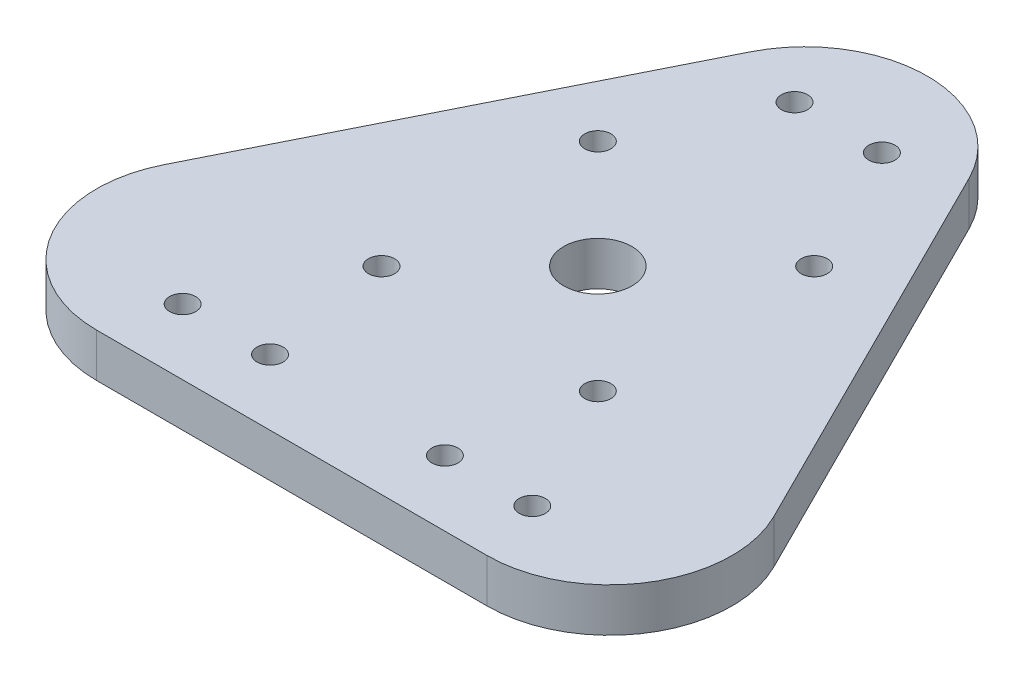
ISO-10303-21;
HEADER;
FILE_DESCRIPTION(('STEP AP214'),'2;1');
FILE_NAME('part.step','',(''),(''),'','','');
FILE_SCHEMA(('AUTOMOTIVE_DESIGN { 1 0 10303 214 1 1 1 1 }'));
ENDSEC;
DATA;
#1=APPLICATION_CONTEXT('core data for automotive mechanical design processes');
#2=APPLICATION_PROTOCOL_DEFINITION('international standard','automotive_design',2000,#1);
#3=PRODUCT_CONTEXT('',#1,'mechanical');
#4=PRODUCT('Part','Part','',(#3));
#5=PRODUCT_RELATED_PRODUCT_CATEGORY('part','',(#4));
#6=PRODUCT_DEFINITION_FORMATION('','',#4);
#7=PRODUCT_DEFINITION_CONTEXT('part definition',#1,'design');
#8=PRODUCT_DEFINITION('design','',#6,#7);
#9=PRODUCT_DEFINITION_SHAPE('','',#8);
#10=(LENGTH_UNIT() NAMED_UNIT(*) SI_UNIT(.MILLI.,.METRE.));
#11=(NAMED_UNIT(*) PLANE_ANGLE_UNIT() SI_UNIT($,.RADIAN.));
#12=(NAMED_UNIT(*) SI_UNIT($,.STERADIAN.) SOLID_ANGLE_UNIT());
#13=UNCERTAINTY_MEASURE_WITH_UNIT(LENGTH_MEASURE(1.E-05),#10,'distance_accuracy_value','');
#14=(GEOMETRIC_REPRESENTATION_CONTEXT(3) GLOBAL_UNCERTAINTY_ASSIGNED_CONTEXT((#13)) GLOBAL_UNIT_ASSIGNED_CONTEXT((#10,
#11,#12)) REPRESENTATION_CONTEXT('',''));
#15=CARTESIAN_POINT('',(0.,0.,0.));
#16=DIRECTION('',(0.,0.,1.));
#17=DIRECTION('',(1.,0.,0.));
#18=AXIS2_PLACEMENT_3D('',#15,#16,#17);
#19=CARTESIAN_POINT('',(0.,0.,0.));
#20=DIRECTION('',(0.,-1.,0.));
#21=DIRECTION('',(0.,0.,-1.));
#22=AXIS2_PLACEMENT_3D('',#19,#20,#21);
#23=PLANE('',#22);
#24=CARTESIAN_POINT('',(15.7154482118709,0.,-28.7345517881289));
#25=DIRECTION('',(0.,1.,0.));
#26=DIRECTION('',(0.,0.,1.));
#27=AXIS2_PLACEMENT_3D('',#24,#25,#26);
#28=CIRCLE('',#27,1.89865);
#29=CARTESIAN_POINT('',(15.7154482118709,0.,-26.8359017881289));
#30=VERTEX_POINT('',#29);
#31=EDGE_CURVE('E203',#30,#30,#28,.T.);
#32=ORIENTED_EDGE('',*,*,#31,.F.);
#33=EDGE_LOOP('',(#32));
#34=FACE_BOUND('',#33,.T.);
#35=CARTESIAN_POINT('',(15.7154482118712,0.,-60.1654482118709));
#36=DIRECTION('',(0.,1.,0.));
#37=DIRECTION('',(0.,0.,1.));
#38=AXIS2_PLACEMENT_3D('',#35,#36,#37);
#39=CIRCLE('',#38,1.89865);
#40=CARTESIAN_POINT('',(15.7154482118712,0.,-58.2667982118709));
#41=VERTEX_POINT('',#40);
#42=EDGE_CURVE('E191',#41,#41,#39,.T.);
#43=ORIENTED_EDGE('',*,*,#42,.F.);
#44=EDGE_LOOP('',(#43));
#45=FACE_BOUND('',#44,.T.);
#46=CARTESIAN_POINT('',(0.,0.,-44.45));
#47=DIRECTION('',(0.,1.,0.));
#48=DIRECTION('',(0.,0.,1.));
#49=AXIS2_PLACEMENT_3D('',#46,#47,#48);
#50=CIRCLE('',#49,4.96062);
#51=CARTESIAN_POINT('',(0.,0.,-39.48938));
#52=VERTEX_POINT('',#51);
#53=EDGE_CURVE('E185',#52,#52,#50,.T.);
#54=ORIENTED_EDGE('',*,*,#53,.F.);
#55=EDGE_LOOP('',(#54));
#56=FACE_BOUND('',#55,.T.);
#57=CARTESIAN_POINT('',(25.4,0.,-9.525));
#58=DIRECTION('',(0.,1.,0.));
#59=DIRECTION('',(0.,0.,1.));
#60=AXIS2_PLACEMENT_3D('',#57,#58,#59);
#61=CIRCLE('',#60,1.89864999999999);
#62=CARTESIAN_POINT('',(25.4,0.,-7.62635000000001));
#63=VERTEX_POINT('',#62);
#64=EDGE_CURVE('E179',#63,#63,#61,.T.);
#65=ORIENTED_EDGE('',*,*,#64,.F.);
#66=EDGE_LOOP('',(#65));
#67=FACE_BOUND('',#66,.T.);
#68=CARTESIAN_POINT('',(12.7,0.,-9.525));
#69=DIRECTION('',(0.,1.,0.));
#70=DIRECTION('',(0.,0.,1.));
#71=AXIS2_PLACEMENT_3D('',#68,#69,#70);
#72=CIRCLE('',#71,1.89864999999999);
#73=CARTESIAN_POINT('',(12.7,0.,-7.62635000000001));
#74=VERTEX_POINT('',#73);
#75=EDGE_CURVE('E173',#74,#74,#72,.T.);
#76=ORIENTED_EDGE('',*,*,#75,.F.);
#77=EDGE_LOOP('',(#76));
#78=FACE_BOUND('',#77,.T.);
#79=CARTESIAN_POINT('',(-6.35,0.,-79.375));
#80=DIRECTION('',(0.,1.,0.));
#81=DIRECTION('',(0.,0.,1.));
#82=AXIS2_PLACEMENT_3D('',#79,#80,#81);
#83=CIRCLE('',#82,1.89864999999999);
#84=CARTESIAN_POINT('',(-6.35,0.,-77.47635));
#85=VERTEX_POINT('',#84);
#86=EDGE_CURVE('E167',#85,#85,#83,.T.);
#87=ORIENTED_EDGE('',*,*,#86,.F.);
#88=EDGE_LOOP('',(#87));
#89=FACE_BOUND('',#88,.T.);
#90=CARTESIAN_POINT('',(6.35,0.,-79.375));
#91=DIRECTION('',(0.,1.,0.));
#92=DIRECTION('',(0.,0.,1.));
#93=AXIS2_PLACEMENT_3D('',#90,#91,#92);
#94=CIRCLE('',#93,1.89864999999999);
#95=CARTESIAN_POINT('',(6.35,0.,-77.47635));
#96=VERTEX_POINT('',#95);
#97=EDGE_CURVE('E161',#96,#96,#94,.T.);
#98=ORIENTED_EDGE('',*,*,#97,.F.);
#99=EDGE_LOOP('',(#98));
#100=FACE_BOUND('',#99,.T.);
#101=CARTESIAN_POINT('',(-25.4,0.,-9.525));
#102=DIRECTION('',(0.,1.,0.));
#103=DIRECTION('',(0.,0.,1.));
#104=AXIS2_PLACEMENT_3D('',#101,#102,#103);
#105=CIRCLE('',#104,1.89864999999999);
#106=CARTESIAN_POINT('',(-25.4,0.,-7.62635000000001));
#107=VERTEX_POINT('',#106);
#108=EDGE_CURVE('E153',#107,#107,#105,.T.);
#109=ORIENTED_EDGE('',*,*,#108,.F.);
#110=EDGE_LOOP('',(#109));
#111=FACE_BOUND('',#110,.T.);
#112=CARTESIAN_POINT('',(-12.7,0.,-9.525));
#113=DIRECTION('',(0.,1.,0.));
#114=DIRECTION('',(0.,0.,1.));
#115=AXIS2_PLACEMENT_3D('',#112,#113,#114);
#116=CIRCLE('',#115,1.89864999999999);
#117=CARTESIAN_POINT('',(-12.7,0.,-7.62635000000001));
#118=VERTEX_POINT('',#117);
#119=EDGE_CURVE('E145',#118,#118,#116,.T.);
#120=ORIENTED_EDGE('',*,*,#119,.F.);
#121=EDGE_LOOP('',(#120));
#122=FACE_BOUND('',#121,.T.);
#123=DIRECTION('',(-0.447213595499958,0.,-0.894427190999916));
#124=VECTOR('',#123,1.);
#125=CARTESIAN_POINT('',(0.,0.,-114.3));
#126=LINE('',#125,#124);
#127=CARTESIAN_POINT('',(44.2842711360054,0.,-25.7314577279893));
#128=VERTEX_POINT('',#127);
#129=CARTESIAN_POINT('',(15.9029154559785,0.,-82.494169088043));
#130=VERTEX_POINT('',#129);
#131=EDGE_CURVE('E89',#128,#130,#126,.T.);
#132=ORIENTED_EDGE('',*,*,#131,.T.);
#133=CARTESIAN_POINT('',(0.,0.,-74.5427113600537));
#134=DIRECTION('',(0.,-1.,0.));
#135=DIRECTION('',(0.,0.,-1.));
#136=AXIS2_PLACEMENT_3D('',#133,#134,#135);
#137=CIRCLE('',#136,17.78);
#138=CARTESIAN_POINT('',(-15.9029154559785,0.,-82.494169088043));
#139=VERTEX_POINT('',#138);
#140=EDGE_CURVE('E94',#130,#139,#137,.F.);
#141=ORIENTED_EDGE('',*,*,#140,.T.);
#142=DIRECTION('',(-0.447213595499958,0.,0.894427190999916));
#143=VECTOR('',#142,1.);
#144=CARTESIAN_POINT('',(-57.15,0.,0.));
#145=LINE('',#144,#143);
#146=CARTESIAN_POINT('',(-44.2842711360054,0.,-25.7314577279893));
#147=VERTEX_POINT('',#146);
#148=EDGE_CURVE('E104',#139,#147,#145,.T.);
#149=ORIENTED_EDGE('',*,*,#148,.T.);
#150=CARTESIAN_POINT('',(-28.3813556800269,0.,-17.78));
#151=DIRECTION('',(0.,-1.,0.));
#152=DIRECTION('',(0.,0.,-1.));
#153=AXIS2_PLACEMENT_3D('',#150,#151,#152);
#154=CIRCLE('',#153,17.78);
#155=CARTESIAN_POINT('',(-28.3813556800269,0.,0.));
#156=VERTEX_POINT('',#155);
#157=EDGE_CURVE('E95',#147,#156,#154,.F.);
#158=ORIENTED_EDGE('',*,*,#157,.T.);
#159=DIRECTION('',(1.,0.,0.));
#160=VECTOR('',#159,1.);
#161=CARTESIAN_POINT('',(-57.15,0.,0.));
#162=LINE('',#161,#160);
#163=CARTESIAN_POINT('',(28.3813556800269,0.,0.));
#164=VERTEX_POINT('',#163);
#165=EDGE_CURVE('E90',#156,#164,#162,.T.);
#166=ORIENTED_EDGE('',*,*,#165,.T.);
#167=CARTESIAN_POINT('',(28.3813556800269,0.,-17.78));
#168=DIRECTION('',(0.,-1.,0.));
#169=DIRECTION('',(0.,0.,-1.));
#170=AXIS2_PLACEMENT_3D('',#167,#168,#169);
#171=CIRCLE('',#170,17.78);
#172=EDGE_CURVE('E86',#164,#128,#171,.F.);
#173=ORIENTED_EDGE('',*,*,#172,.T.);
#174=EDGE_LOOP('',(#132,#141,#149,#158,#166,#173));
#175=FACE_BOUND('',#174,.T.);
#176=CARTESIAN_POINT('',(-15.7154482118712,0.,-28.7345517881291));
#177=DIRECTION('',(0.,1.,0.));
#178=DIRECTION('',(0.,0.,1.));
#179=AXIS2_PLACEMENT_3D('',#176,#177,#178);
#180=CIRCLE('',#179,1.89865);
#181=CARTESIAN_POINT('',(-15.7154482118712,0.,-26.8359017881291));
#182=VERTEX_POINT('',#181);
#183=EDGE_CURVE('E197',#182,#182,#180,.T.);
#184=ORIENTED_EDGE('',*,*,#183,.F.);
#185=EDGE_LOOP('',(#184));
#186=FACE_BOUND('',#185,.T.);
#187=CARTESIAN_POINT('',(-15.7154482118709,0.,-60.1654482118711));
#188=DIRECTION('',(0.,1.,0.));
#189=DIRECTION('',(0.,0.,1.));
#190=AXIS2_PLACEMENT_3D('',#187,#188,#189);
#191=CIRCLE('',#190,1.89865);
#192=CARTESIAN_POINT('',(-15.7154482118709,0.,-58.2667982118711));
#193=VERTEX_POINT('',#192);
#194=EDGE_CURVE('E209',#193,#193,#191,.T.);
#195=ORIENTED_EDGE('',*,*,#194,.F.);
#196=EDGE_LOOP('',(#195));
#197=FACE_BOUND('',#196,.T.);
#198=ADVANCED_FACE('F32',(#34,#45,#56,#67,#78,#89,#100,#111,#122,#175,#186,#197),#23,.F.);
#199=CARTESIAN_POINT('',(-57.15,-6.35,0.));
#200=DIRECTION('',(0.,0.,1.));
#201=DIRECTION('',(1.,0.,0.));
#202=AXIS2_PLACEMENT_3D('',#199,#200,#201);
#203=PLANE('',#202);
#204=DIRECTION('',(1.,0.,0.));
#205=VECTOR('',#204,1.);
#206=CARTESIAN_POINT('',(-57.15,-6.35,0.));
#207=LINE('',#206,#205);
#208=CARTESIAN_POINT('',(-28.3813556800269,-6.35,0.));
#209=VERTEX_POINT('',#208);
#210=CARTESIAN_POINT('',(28.3813556800269,-6.35,0.));
#211=VERTEX_POINT('',#210);
#212=EDGE_CURVE('E131',#209,#211,#207,.T.);
#213=ORIENTED_EDGE('',*,*,#212,.T.);
#214=DIRECTION('',(0.,1.,0.));
#215=VECTOR('',#214,1.);
#216=CARTESIAN_POINT('',(28.3813556800269,-6.35,0.));
#217=LINE('',#216,#215);
#218=EDGE_CURVE('E11',#211,#164,#217,.T.);
#219=ORIENTED_EDGE('',*,*,#218,.T.);
#220=ORIENTED_EDGE('',*,*,#165,.F.);
#221=DIRECTION('',(0.,1.,0.));
#222=VECTOR('',#221,1.);
#223=CARTESIAN_POINT('',(-28.3813556800269,-6.35,0.));
#224=LINE('',#223,#222);
#225=EDGE_CURVE('E40',#156,#209,#224,.F.);
#226=ORIENTED_EDGE('',*,*,#225,.T.);
#227=EDGE_LOOP('',(#213,#219,#220,#226));
#228=FACE_BOUND('',#227,.T.);
#229=ADVANCED_FACE('F217',(#228),#203,.T.);
#230=CARTESIAN_POINT('',(-57.15,-6.35,0.));
#231=DIRECTION('',(-0.894427190999916,0.,-0.447213595499958));
#232=DIRECTION('',(-0.447213595499958,0.,0.894427190999916));
#233=AXIS2_PLACEMENT_3D('',#230,#231,#232);
#234=PLANE('',#233);
#235=ORIENTED_EDGE('',*,*,#148,.F.);
#236=DIRECTION('',(0.,1.,0.));
#237=VECTOR('',#236,1.);
#238=CARTESIAN_POINT('',(-15.9029154559785,-6.35,-82.494169088043));
#239=LINE('',#238,#237);
#240=CARTESIAN_POINT('',(-15.9029154559785,-6.35,-82.494169088043));
#241=VERTEX_POINT('',#240);
#242=EDGE_CURVE('E120',#139,#241,#239,.F.);
#243=ORIENTED_EDGE('',*,*,#242,.T.);
#244=DIRECTION('',(-0.447213595499958,0.,0.894427190999916));
#245=VECTOR('',#244,1.);
#246=CARTESIAN_POINT('',(-57.15,-6.35,0.));
#247=LINE('',#246,#245);
#248=CARTESIAN_POINT('',(-44.2842711360054,-6.35,-25.7314577279893));
#249=VERTEX_POINT('',#248);
#250=EDGE_CURVE('E107',#241,#249,#247,.T.);
#251=ORIENTED_EDGE('',*,*,#250,.T.);
#252=DIRECTION('',(0.,1.,0.));
#253=VECTOR('',#252,1.);
#254=CARTESIAN_POINT('',(-44.2842711360054,-6.35,-25.7314577279893));
#255=LINE('',#254,#253);
#256=EDGE_CURVE('E117',#249,#147,#255,.T.);
#257=ORIENTED_EDGE('',*,*,#256,.T.);
#258=EDGE_LOOP('',(#235,#243,#251,#257));
#259=FACE_BOUND('',#258,.T.);
#260=ADVANCED_FACE('F137',(#259),#234,.T.);
#261=CARTESIAN_POINT('',(0.,-6.35,-114.3));
#262=DIRECTION('',(0.894427190999916,0.,-0.447213595499958));
#263=DIRECTION('',(-0.447213595499958,0.,-0.894427190999916));
#264=AXIS2_PLACEMENT_3D('',#261,#262,#263);
#265=PLANE('',#264);
#266=DIRECTION('',(-0.447213595499958,0.,-0.894427190999916));
#267=VECTOR('',#266,1.);
#268=CARTESIAN_POINT('',(0.,-6.35,-114.3));
#269=LINE('',#268,#267);
#270=CARTESIAN_POINT('',(44.2842711360054,-6.35,-25.7314577279893));
#271=VERTEX_POINT('',#270);
#272=CARTESIAN_POINT('',(15.9029154559785,-6.35,-82.494169088043));
#273=VERTEX_POINT('',#272);
#274=EDGE_CURVE('E111',#271,#273,#269,.T.);
#275=ORIENTED_EDGE('',*,*,#274,.T.);
#276=DIRECTION('',(0.,1.,0.));
#277=VECTOR('',#276,1.);
#278=CARTESIAN_POINT('',(15.9029154559785,-6.35,-82.494169088043));
#279=LINE('',#278,#277);
#280=EDGE_CURVE('E103',#273,#130,#279,.T.);
#281=ORIENTED_EDGE('',*,*,#280,.T.);
#282=ORIENTED_EDGE('',*,*,#131,.F.);
#283=DIRECTION('',(0.,1.,0.));
#284=VECTOR('',#283,1.);
#285=CARTESIAN_POINT('',(44.2842711360054,-6.35,-25.7314577279893));
#286=LINE('',#285,#284);
#287=EDGE_CURVE('E101',#128,#271,#286,.F.);
#288=ORIENTED_EDGE('',*,*,#287,.T.);
#289=EDGE_LOOP('',(#275,#281,#282,#288));
#290=FACE_BOUND('',#289,.T.);
#291=ADVANCED_FACE('F100',(#290),#265,.T.);
#292=CARTESIAN_POINT('',(0.,-6.35,0.));
#293=DIRECTION('',(0.,-1.,0.));
#294=DIRECTION('',(0.,0.,-1.));
#295=AXIS2_PLACEMENT_3D('',#292,#293,#294);
#296=PLANE('',#295);
#297=CARTESIAN_POINT('',(-15.7154482118709,-6.35,-60.1654482118711));
#298=DIRECTION('',(0.,-1.,0.));
#299=DIRECTION('',(0.,0.,-1.));
#300=AXIS2_PLACEMENT_3D('',#297,#298,#299);
#301=CIRCLE('',#300,1.89865);
#302=CARTESIAN_POINT('',(-15.7154482118709,-6.35,-62.0640982118711));
#303=VERTEX_POINT('',#302);
#304=EDGE_CURVE('E206',#303,#303,#301,.T.);
#305=ORIENTED_EDGE('',*,*,#304,.F.);
#306=EDGE_LOOP('',(#305));
#307=FACE_BOUND('',#306,.T.);
#308=CARTESIAN_POINT('',(15.7154482118709,-6.35,-28.7345517881289));
#309=DIRECTION('',(0.,-1.,0.));
#310=DIRECTION('',(0.,0.,-1.));
#311=AXIS2_PLACEMENT_3D('',#308,#309,#310);
#312=CIRCLE('',#311,1.89865);
#313=CARTESIAN_POINT('',(15.7154482118709,-6.35,-30.6332017881289));
#314=VERTEX_POINT('',#313);
#315=EDGE_CURVE('E200',#314,#314,#312,.T.);
#316=ORIENTED_EDGE('',*,*,#315,.F.);
#317=EDGE_LOOP('',(#316));
#318=FACE_BOUND('',#317,.T.);
#319=CARTESIAN_POINT('',(-15.7154482118712,-6.35,-28.7345517881291));
#320=DIRECTION('',(0.,-1.,0.));
#321=DIRECTION('',(0.,0.,-1.));
#322=AXIS2_PLACEMENT_3D('',#319,#320,#321);
#323=CIRCLE('',#322,1.89865);
#324=CARTESIAN_POINT('',(-15.7154482118712,-6.35,-30.6332017881291));
#325=VERTEX_POINT('',#324);
#326=EDGE_CURVE('E194',#325,#325,#323,.T.);
#327=ORIENTED_EDGE('',*,*,#326,.F.);
#328=EDGE_LOOP('',(#327));
#329=FACE_BOUND('',#328,.T.);
#330=CARTESIAN_POINT('',(15.7154482118712,-6.35,-60.1654482118709));
#331=DIRECTION('',(0.,-1.,0.));
#332=DIRECTION('',(0.,0.,-1.));
#333=AXIS2_PLACEMENT_3D('',#330,#331,#332);
#334=CIRCLE('',#333,1.89865);
#335=CARTESIAN_POINT('',(15.7154482118712,-6.35,-62.0640982118709));
#336=VERTEX_POINT('',#335);
#337=EDGE_CURVE('E188',#336,#336,#334,.T.);
#338=ORIENTED_EDGE('',*,*,#337,.F.);
#339=EDGE_LOOP('',(#338));
#340=FACE_BOUND('',#339,.T.);
#341=CARTESIAN_POINT('',(0.,-6.35,-44.45));
#342=DIRECTION('',(0.,1.,0.));
#343=DIRECTION('',(0.,0.,1.));
#344=AXIS2_PLACEMENT_3D('',#341,#342,#343);
#345=CIRCLE('',#344,4.96062);
#346=CARTESIAN_POINT('',(0.,-6.35,-39.48938));
#347=VERTEX_POINT('',#346);
#348=EDGE_CURVE('E182',#347,#347,#345,.T.);
#349=ORIENTED_EDGE('',*,*,#348,.T.);
#350=EDGE_LOOP('',(#349));
#351=FACE_BOUND('',#350,.T.);
#352=CARTESIAN_POINT('',(25.4,-6.34999999999999,-9.525));
#353=DIRECTION('',(0.,1.,0.));
#354=DIRECTION('',(0.,0.,1.));
#355=AXIS2_PLACEMENT_3D('',#352,#353,#354);
#356=CIRCLE('',#355,1.89864999999999);
#357=CARTESIAN_POINT('',(25.4,-6.34999999999999,-7.62635000000001));
#358=VERTEX_POINT('',#357);
#359=EDGE_CURVE('E176',#358,#358,#356,.T.);
#360=ORIENTED_EDGE('',*,*,#359,.T.);
#361=EDGE_LOOP('',(#360));
#362=FACE_BOUND('',#361,.T.);
#363=CARTESIAN_POINT('',(12.7,-6.34999999999999,-9.525));
#364=DIRECTION('',(0.,1.,0.));
#365=DIRECTION('',(0.,0.,1.));
#366=AXIS2_PLACEMENT_3D('',#363,#364,#365);
#367=CIRCLE('',#366,1.89864999999999);
#368=CARTESIAN_POINT('',(12.7,-6.34999999999999,-7.62635000000001));
#369=VERTEX_POINT('',#368);
#370=EDGE_CURVE('E170',#369,#369,#367,.T.);
#371=ORIENTED_EDGE('',*,*,#370,.T.);
#372=EDGE_LOOP('',(#371));
#373=FACE_BOUND('',#372,.T.);
#374=CARTESIAN_POINT('',(-6.35,-6.34999999999999,-79.375));
#375=DIRECTION('',(0.,1.,0.));
#376=DIRECTION('',(0.,0.,1.));
#377=AXIS2_PLACEMENT_3D('',#374,#375,#376);
#378=CIRCLE('',#377,1.89864999999999);
#379=CARTESIAN_POINT('',(-6.35,-6.34999999999999,-77.47635));
#380=VERTEX_POINT('',#379);
#381=EDGE_CURVE('E164',#380,#380,#378,.T.);
#382=ORIENTED_EDGE('',*,*,#381,.T.);
#383=EDGE_LOOP('',(#382));
#384=FACE_BOUND('',#383,.T.);
#385=CARTESIAN_POINT('',(6.35,-6.34999999999999,-79.375));
#386=DIRECTION('',(0.,1.,0.));
#387=DIRECTION('',(0.,0.,1.));
#388=AXIS2_PLACEMENT_3D('',#385,#386,#387);
#389=CIRCLE('',#388,1.89864999999999);
#390=CARTESIAN_POINT('',(6.35,-6.34999999999999,-77.47635));
#391=VERTEX_POINT('',#390);
#392=EDGE_CURVE('E158',#391,#391,#389,.T.);
#393=ORIENTED_EDGE('',*,*,#392,.T.);
#394=EDGE_LOOP('',(#393));
#395=FACE_BOUND('',#394,.T.);
#396=CARTESIAN_POINT('',(-25.4,-6.34999999999999,-9.525));
#397=DIRECTION('',(0.,1.,0.));
#398=DIRECTION('',(0.,0.,1.));
#399=AXIS2_PLACEMENT_3D('',#396,#397,#398);
#400=CIRCLE('',#399,1.89864999999999);
#401=CARTESIAN_POINT('',(-25.4,-6.34999999999999,-7.62635000000001));
#402=VERTEX_POINT('',#401);
#403=EDGE_CURVE('E149',#402,#402,#400,.T.);
#404=ORIENTED_EDGE('',*,*,#403,.T.);
#405=EDGE_LOOP('',(#404));
#406=FACE_BOUND('',#405,.T.);
#407=CARTESIAN_POINT('',(-12.7,-6.34999999999999,-9.525));
#408=DIRECTION('',(0.,1.,0.));
#409=DIRECTION('',(0.,0.,1.));
#410=AXIS2_PLACEMENT_3D('',#407,#408,#409);
#411=CIRCLE('',#410,1.89864999999999);
#412=CARTESIAN_POINT('',(-12.7,-6.34999999999999,-7.62635000000001));
#413=VERTEX_POINT('',#412);
#414=EDGE_CURVE('E141',#413,#413,#411,.T.);
#415=ORIENTED_EDGE('',*,*,#414,.T.);
#416=EDGE_LOOP('',(#415));
#417=FACE_BOUND('',#416,.T.);
#418=ORIENTED_EDGE('',*,*,#250,.F.);
#419=CARTESIAN_POINT('',(0.,-6.35,-74.5427113600537));
#420=DIRECTION('',(0.,-1.,0.));
#421=DIRECTION('',(0.,0.,-1.));
#422=AXIS2_PLACEMENT_3D('',#419,#420,#421);
#423=CIRCLE('',#422,17.78);
#424=EDGE_CURVE('E125',#241,#273,#423,.T.);
#425=ORIENTED_EDGE('',*,*,#424,.T.);
#426=ORIENTED_EDGE('',*,*,#274,.F.);
#427=CARTESIAN_POINT('',(28.3813556800269,-6.35,-17.78));
#428=DIRECTION('',(0.,-1.,0.));
#429=DIRECTION('',(0.,0.,-1.));
#430=AXIS2_PLACEMENT_3D('',#427,#428,#429);
#431=CIRCLE('',#430,17.78);
#432=EDGE_CURVE('E47',#271,#211,#431,.T.);
#433=ORIENTED_EDGE('',*,*,#432,.T.);
#434=ORIENTED_EDGE('',*,*,#212,.F.);
#435=CARTESIAN_POINT('',(-28.3813556800269,-6.35,-17.78));
#436=DIRECTION('',(0.,-1.,0.));
#437=DIRECTION('',(0.,0.,-1.));
#438=AXIS2_PLACEMENT_3D('',#435,#436,#437);
#439=CIRCLE('',#438,17.78);
#440=EDGE_CURVE('E122',#209,#249,#439,.T.);
#441=ORIENTED_EDGE('',*,*,#440,.T.);
#442=EDGE_LOOP('',(#418,#425,#426,#433,#434,#441));
#443=FACE_BOUND('',#442,.T.);
#444=ADVANCED_FACE('F128',(#307,#318,#329,#340,#351,#362,#373,#384,#395,#406,#417,#443),#296,.T.);
#445=CARTESIAN_POINT('',(-12.7,0.,-9.525));
#446=DIRECTION('',(0.,1.,0.));
#447=DIRECTION('',(0.,0.,1.));
#448=AXIS2_PLACEMENT_3D('',#445,#446,#447);
#449=CYLINDRICAL_SURFACE('',#448,1.89864999999999);
#450=ORIENTED_EDGE('',*,*,#414,.F.);
#451=EDGE_LOOP('',(#450));
#452=FACE_BOUND('',#451,.T.);
#453=ORIENTED_EDGE('',*,*,#119,.T.);
#454=EDGE_LOOP('',(#453));
#455=FACE_BOUND('',#454,.T.);
#456=ADVANCED_FACE('F275',(#452,#455),#449,.F.);
#457=CARTESIAN_POINT('',(-25.4,0.,-9.525));
#458=DIRECTION('',(0.,1.,0.));
#459=DIRECTION('',(0.,0.,1.));
#460=AXIS2_PLACEMENT_3D('',#457,#458,#459);
#461=CYLINDRICAL_SURFACE('',#460,1.89864999999999);
#462=ORIENTED_EDGE('',*,*,#403,.F.);
#463=EDGE_LOOP('',(#462));
#464=FACE_BOUND('',#463,.T.);
#465=ORIENTED_EDGE('',*,*,#108,.T.);
#466=EDGE_LOOP('',(#465));
#467=FACE_BOUND('',#466,.T.);
#468=ADVANCED_FACE('F272',(#464,#467),#461,.F.);
#469=CARTESIAN_POINT('',(6.35,0.,-79.375));
#470=DIRECTION('',(0.,1.,0.));
#471=DIRECTION('',(0.,0.,1.));
#472=AXIS2_PLACEMENT_3D('',#469,#470,#471);
#473=CYLINDRICAL_SURFACE('',#472,1.89864999999999);
#474=ORIENTED_EDGE('',*,*,#392,.F.);
#475=EDGE_LOOP('',(#474));
#476=FACE_BOUND('',#475,.T.);
#477=ORIENTED_EDGE('',*,*,#97,.T.);
#478=EDGE_LOOP('',(#477));
#479=FACE_BOUND('',#478,.T.);
#480=ADVANCED_FACE('F268',(#476,#479),#473,.F.);
#481=CARTESIAN_POINT('',(-6.35,0.,-79.375));
#482=DIRECTION('',(0.,1.,0.));
#483=DIRECTION('',(0.,0.,1.));
#484=AXIS2_PLACEMENT_3D('',#481,#482,#483);
#485=CYLINDRICAL_SURFACE('',#484,1.89864999999999);
#486=ORIENTED_EDGE('',*,*,#381,.F.);
#487=EDGE_LOOP('',(#486));
#488=FACE_BOUND('',#487,.T.);
#489=ORIENTED_EDGE('',*,*,#86,.T.);
#490=EDGE_LOOP('',(#489));
#491=FACE_BOUND('',#490,.T.);
#492=ADVANCED_FACE('F264',(#488,#491),#485,.F.);
#493=CARTESIAN_POINT('',(12.7,0.,-9.525));
#494=DIRECTION('',(0.,1.,0.));
#495=DIRECTION('',(0.,0.,1.));
#496=AXIS2_PLACEMENT_3D('',#493,#494,#495);
#497=CYLINDRICAL_SURFACE('',#496,1.89864999999999);
#498=ORIENTED_EDGE('',*,*,#370,.F.);
#499=EDGE_LOOP('',(#498));
#500=FACE_BOUND('',#499,.T.);
#501=ORIENTED_EDGE('',*,*,#75,.T.);
#502=EDGE_LOOP('',(#501));
#503=FACE_BOUND('',#502,.T.);
#504=ADVANCED_FACE('F260',(#500,#503),#497,.F.);
#505=CARTESIAN_POINT('',(25.4,0.,-9.525));
#506=DIRECTION('',(0.,1.,0.));
#507=DIRECTION('',(0.,0.,1.));
#508=AXIS2_PLACEMENT_3D('',#505,#506,#507);
#509=CYLINDRICAL_SURFACE('',#508,1.89864999999999);
#510=ORIENTED_EDGE('',*,*,#359,.F.);
#511=EDGE_LOOP('',(#510));
#512=FACE_BOUND('',#511,.T.);
#513=ORIENTED_EDGE('',*,*,#64,.T.);
#514=EDGE_LOOP('',(#513));
#515=FACE_BOUND('',#514,.T.);
#516=ADVANCED_FACE('F234',(#512,#515),#509,.F.);
#517=CARTESIAN_POINT('',(0.,-6.35,-74.5427113600537));
#518=DIRECTION('',(0.,1.,0.));
#519=DIRECTION('',(0.,0.,1.));
#520=AXIS2_PLACEMENT_3D('',#517,#518,#519);
#521=CYLINDRICAL_SURFACE('',#520,17.78);
#522=ORIENTED_EDGE('',*,*,#424,.F.);
#523=ORIENTED_EDGE('',*,*,#242,.F.);
#524=ORIENTED_EDGE('',*,*,#140,.F.);
#525=ORIENTED_EDGE('',*,*,#280,.F.);
#526=EDGE_LOOP('',(#522,#523,#524,#525));
#527=FACE_BOUND('',#526,.T.);
#528=ADVANCED_FACE('F133',(#527),#521,.T.);
#529=CARTESIAN_POINT('',(28.3813556800269,-6.35,-17.78));
#530=DIRECTION('',(0.,1.,0.));
#531=DIRECTION('',(0.,0.,1.));
#532=AXIS2_PLACEMENT_3D('',#529,#530,#531);
#533=CYLINDRICAL_SURFACE('',#532,17.78);
#534=ORIENTED_EDGE('',*,*,#432,.F.);
#535=ORIENTED_EDGE('',*,*,#287,.F.);
#536=ORIENTED_EDGE('',*,*,#172,.F.);
#537=ORIENTED_EDGE('',*,*,#218,.F.);
#538=EDGE_LOOP('',(#534,#535,#536,#537));
#539=FACE_BOUND('',#538,.T.);
#540=ADVANCED_FACE('F106',(#539),#533,.T.);
#541=CARTESIAN_POINT('',(-28.3813556800269,-6.35,-17.78));
#542=DIRECTION('',(0.,1.,0.));
#543=DIRECTION('',(0.,0.,1.));
#544=AXIS2_PLACEMENT_3D('',#541,#542,#543);
#545=CYLINDRICAL_SURFACE('',#544,17.78);
#546=ORIENTED_EDGE('',*,*,#440,.F.);
#547=ORIENTED_EDGE('',*,*,#225,.F.);
#548=ORIENTED_EDGE('',*,*,#157,.F.);
#549=ORIENTED_EDGE('',*,*,#256,.F.);
#550=EDGE_LOOP('',(#546,#547,#548,#549));
#551=FACE_BOUND('',#550,.T.);
#552=ADVANCED_FACE('F34',(#551),#545,.T.);
#553=CARTESIAN_POINT('',(0.,0.,-44.45));
#554=DIRECTION('',(0.,1.,0.));
#555=DIRECTION('',(0.,0.,1.));
#556=AXIS2_PLACEMENT_3D('',#553,#554,#555);
#557=CYLINDRICAL_SURFACE('',#556,4.96062);
#558=ORIENTED_EDGE('',*,*,#348,.F.);
#559=EDGE_LOOP('',(#558));
#560=FACE_BOUND('',#559,.T.);
#561=ORIENTED_EDGE('',*,*,#53,.T.);
#562=EDGE_LOOP('',(#561));
#563=FACE_BOUND('',#562,.T.);
#564=ADVANCED_FACE('F239',(#560,#563),#557,.F.);
#565=CARTESIAN_POINT('',(15.7154482118712,0.,-60.1654482118709));
#566=DIRECTION('',(0.,1.,0.));
#567=DIRECTION('',(0.,0.,1.));
#568=AXIS2_PLACEMENT_3D('',#565,#566,#567);
#569=CYLINDRICAL_SURFACE('',#568,1.89865);
#570=ORIENTED_EDGE('',*,*,#42,.T.);
#571=EDGE_LOOP('',(#570));
#572=FACE_BOUND('',#571,.T.);
#573=ORIENTED_EDGE('',*,*,#337,.T.);
#574=EDGE_LOOP('',(#573));
#575=FACE_BOUND('',#574,.T.);
#576=ADVANCED_FACE('F244',(#572,#575),#569,.F.);
#577=CARTESIAN_POINT('',(-15.7154482118712,0.,-28.7345517881291));
#578=DIRECTION('',(0.,1.,0.));
#579=DIRECTION('',(0.,0.,1.));
#580=AXIS2_PLACEMENT_3D('',#577,#578,#579);
#581=CYLINDRICAL_SURFACE('',#580,1.89865);
#582=ORIENTED_EDGE('',*,*,#183,.T.);
#583=EDGE_LOOP('',(#582));
#584=FACE_BOUND('',#583,.T.);
#585=ORIENTED_EDGE('',*,*,#326,.T.);
#586=EDGE_LOOP('',(#585));
#587=FACE_BOUND('',#586,.T.);
#588=ADVANCED_FACE('F251',(#584,#587),#581,.F.);
#589=CARTESIAN_POINT('',(15.7154482118709,0.,-28.7345517881289));
#590=DIRECTION('',(0.,1.,0.));
#591=DIRECTION('',(0.,0.,1.));
#592=AXIS2_PLACEMENT_3D('',#589,#590,#591);
#593=CYLINDRICAL_SURFACE('',#592,1.89865);
#594=ORIENTED_EDGE('',*,*,#31,.T.);
#595=EDGE_LOOP('',(#594));
#596=FACE_BOUND('',#595,.T.);
#597=ORIENTED_EDGE('',*,*,#315,.T.);
#598=EDGE_LOOP('',(#597));
#599=FACE_BOUND('',#598,.T.);
#600=ADVANCED_FACE('F322',(#596,#599),#593,.F.);
#601=CARTESIAN_POINT('',(-15.7154482118709,0.,-60.1654482118711));
#602=DIRECTION('',(0.,1.,0.));
#603=DIRECTION('',(0.,0.,1.));
#604=AXIS2_PLACEMENT_3D('',#601,#602,#603);
#605=CYLINDRICAL_SURFACE('',#604,1.89865);
#606=ORIENTED_EDGE('',*,*,#194,.T.);
#607=EDGE_LOOP('',(#606));
#608=FACE_BOUND('',#607,.T.);
#609=ORIENTED_EDGE('',*,*,#304,.T.);
#610=EDGE_LOOP('',(#609));
#611=FACE_BOUND('',#610,.T.);
#612=ADVANCED_FACE('F213',(#608,#611),#605,.F.);
#613=CLOSED_SHELL('',(#198,#229,#260,#291,#444,#456,#468,#480,#492,#504,#516,#528,#540,#552,
#564,#576,#588,#600,#612));
#614=MANIFOLD_SOLID_BREP('B2',#613);
#615=ADVANCED_BREP_SHAPE_REPRESENTATION('',(#18,#614),#14);
#616=SHAPE_DEFINITION_REPRESENTATION(#9,#615);
ENDSEC;
END-ISO-10303-21;
